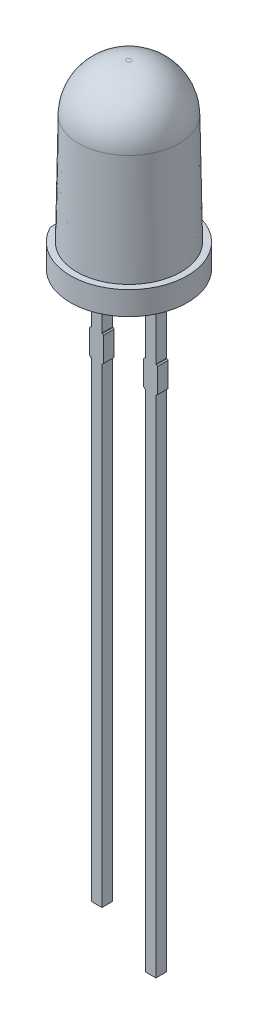
ISO-10303-21;
HEADER;
FILE_DESCRIPTION(('STEP AP214'),'2;1');
FILE_NAME('part.step','',(''),(''),'','','');
FILE_SCHEMA(('AUTOMOTIVE_DESIGN { 1 0 10303 214 1 1 1 1 }'));
ENDSEC;
DATA;
#1=APPLICATION_CONTEXT('core data for automotive mechanical design processes');
#2=APPLICATION_PROTOCOL_DEFINITION('international standard','automotive_design',2000,#1);
#3=PRODUCT_CONTEXT('',#1,'mechanical');
#4=PRODUCT('Part','Part','',(#3));
#5=PRODUCT_RELATED_PRODUCT_CATEGORY('part','',(#4));
#6=PRODUCT_DEFINITION_FORMATION('','',#4);
#7=PRODUCT_DEFINITION_CONTEXT('part definition',#1,'design');
#8=PRODUCT_DEFINITION('design','',#6,#7);
#9=PRODUCT_DEFINITION_SHAPE('','',#8);
#10=(LENGTH_UNIT() NAMED_UNIT(*) SI_UNIT(.MILLI.,.METRE.));
#11=(NAMED_UNIT(*) PLANE_ANGLE_UNIT() SI_UNIT($,.RADIAN.));
#12=(NAMED_UNIT(*) SI_UNIT($,.STERADIAN.) SOLID_ANGLE_UNIT());
#13=UNCERTAINTY_MEASURE_WITH_UNIT(LENGTH_MEASURE(1.E-05),#10,'distance_accuracy_value','');
#14=(GEOMETRIC_REPRESENTATION_CONTEXT(3) GLOBAL_UNCERTAINTY_ASSIGNED_CONTEXT((#13)) GLOBAL_UNIT_ASSIGNED_CONTEXT((#10,
#11,#12)) REPRESENTATION_CONTEXT('',''));
#15=CARTESIAN_POINT('',(0.,0.,0.));
#16=DIRECTION('',(0.,0.,1.));
#17=DIRECTION('',(1.,0.,0.));
#18=AXIS2_PLACEMENT_3D('',#15,#16,#17);
#19=CARTESIAN_POINT('',(-1.02,-28.,0.25));
#20=DIRECTION('',(-1.,0.,0.));
#21=DIRECTION('',(0.,0.,1.));
#22=AXIS2_PLACEMENT_3D('',#19,#20,#21);
#23=PLANE('',#22);
#24=DIRECTION('',(0.,1.,0.));
#25=VECTOR('',#24,1.);
#26=CARTESIAN_POINT('',(-1.02,-28.,0.25));
#27=LINE('',#26,#25);
#28=CARTESIAN_POINT('',(-1.02,-3.,0.25));
#29=VERTEX_POINT('',#28);
#30=CARTESIAN_POINT('',(-1.02,0.,0.25));
#31=VERTEX_POINT('',#30);
#32=EDGE_CURVE('E319',#29,#31,#27,.T.);
#33=ORIENTED_EDGE('',*,*,#32,.F.);
#34=DIRECTION('',(0.,0.,-1.));
#35=VECTOR('',#34,1.);
#36=CARTESIAN_POINT('',(-1.02,-3.,0.25));
#37=LINE('',#36,#35);
#38=CARTESIAN_POINT('',(-1.02,-3.,-0.25));
#39=VERTEX_POINT('',#38);
#40=EDGE_CURVE('E552',#29,#39,#37,.T.);
#41=ORIENTED_EDGE('',*,*,#40,.T.);
#42=DIRECTION('',(0.,1.,0.));
#43=VECTOR('',#42,1.);
#44=CARTESIAN_POINT('',(-1.02,-28.,-0.25));
#45=LINE('',#44,#43);
#46=CARTESIAN_POINT('',(-1.02,0.,-0.25));
#47=VERTEX_POINT('',#46);
#48=EDGE_CURVE('E368',#39,#47,#45,.T.);
#49=ORIENTED_EDGE('',*,*,#48,.T.);
#50=DIRECTION('',(0.,0.,1.));
#51=VECTOR('',#50,1.);
#52=CARTESIAN_POINT('',(-1.02,0.,0.25));
#53=LINE('',#52,#51);
#54=EDGE_CURVE('E485',#47,#31,#53,.T.);
#55=ORIENTED_EDGE('',*,*,#54,.T.);
#56=EDGE_LOOP('',(#33,#41,#49,#55));
#57=FACE_BOUND('',#56,.T.);
#58=ADVANCED_FACE('F48',(#57),#23,.F.);
#59=CARTESIAN_POINT('',(-1.52,-28.,0.25));
#60=DIRECTION('',(1.,0.,0.));
#61=DIRECTION('',(0.,0.,-1.));
#62=AXIS2_PLACEMENT_3D('',#59,#60,#61);
#63=PLANE('',#62);
#64=DIRECTION('',(0.,1.,0.));
#65=VECTOR('',#64,1.);
#66=CARTESIAN_POINT('',(-1.52,-28.,-0.25));
#67=LINE('',#66,#65);
#68=CARTESIAN_POINT('',(-1.52,-3.,-0.25));
#69=VERTEX_POINT('',#68);
#70=CARTESIAN_POINT('',(-1.52,0.,-0.25));
#71=VERTEX_POINT('',#70);
#72=EDGE_CURVE('E307',#69,#71,#67,.T.);
#73=ORIENTED_EDGE('',*,*,#72,.F.);
#74=DIRECTION('',(0.,0.,1.));
#75=VECTOR('',#74,1.);
#76=CARTESIAN_POINT('',(-1.52,-3.,0.25));
#77=LINE('',#76,#75);
#78=CARTESIAN_POINT('',(-1.52,-3.,0.25));
#79=VERTEX_POINT('',#78);
#80=EDGE_CURVE('E554',#69,#79,#77,.T.);
#81=ORIENTED_EDGE('',*,*,#80,.T.);
#82=DIRECTION('',(0.,1.,0.));
#83=VECTOR('',#82,1.);
#84=CARTESIAN_POINT('',(-1.52,-28.,0.25));
#85=LINE('',#84,#83);
#86=CARTESIAN_POINT('',(-1.52,0.,0.25));
#87=VERTEX_POINT('',#86);
#88=EDGE_CURVE('E306',#79,#87,#85,.T.);
#89=ORIENTED_EDGE('',*,*,#88,.T.);
#90=DIRECTION('',(0.,0.,-1.));
#91=VECTOR('',#90,1.);
#92=CARTESIAN_POINT('',(-1.52,0.,0.25));
#93=LINE('',#92,#91);
#94=EDGE_CURVE('E501',#87,#71,#93,.T.);
#95=ORIENTED_EDGE('',*,*,#94,.T.);
#96=EDGE_LOOP('',(#73,#81,#89,#95));
#97=FACE_BOUND('',#96,.T.);
#98=ADVANCED_FACE('F626',(#97),#63,.F.);
#99=CARTESIAN_POINT('',(1.52,-28.,0.25));
#100=DIRECTION('',(-1.,0.,0.));
#101=DIRECTION('',(0.,0.,1.));
#102=AXIS2_PLACEMENT_3D('',#99,#100,#101);
#103=PLANE('',#102);
#104=DIRECTION('',(0.,1.,0.));
#105=VECTOR('',#104,1.);
#106=CARTESIAN_POINT('',(1.52,-28.,0.25));
#107=LINE('',#106,#105);
#108=CARTESIAN_POINT('',(1.52,-3.,0.25));
#109=VERTEX_POINT('',#108);
#110=CARTESIAN_POINT('',(1.52,0.,0.25));
#111=VERTEX_POINT('',#110);
#112=EDGE_CURVE('E536',#109,#111,#107,.T.);
#113=ORIENTED_EDGE('',*,*,#112,.F.);
#114=DIRECTION('',(0.,0.,-1.));
#115=VECTOR('',#114,1.);
#116=CARTESIAN_POINT('',(1.52,-3.,0.25));
#117=LINE('',#116,#115);
#118=CARTESIAN_POINT('',(1.52,-3.,-0.25));
#119=VERTEX_POINT('',#118);
#120=EDGE_CURVE('E568',#109,#119,#117,.T.);
#121=ORIENTED_EDGE('',*,*,#120,.T.);
#122=DIRECTION('',(0.,1.,0.));
#123=VECTOR('',#122,1.);
#124=CARTESIAN_POINT('',(1.52,-28.,-0.25));
#125=LINE('',#124,#123);
#126=CARTESIAN_POINT('',(1.52,0.,-0.25));
#127=VERTEX_POINT('',#126);
#128=EDGE_CURVE('E543',#119,#127,#125,.T.);
#129=ORIENTED_EDGE('',*,*,#128,.T.);
#130=DIRECTION('',(0.,0.,1.));
#131=VECTOR('',#130,1.);
#132=CARTESIAN_POINT('',(1.52,0.,0.25));
#133=LINE('',#132,#131);
#134=EDGE_CURVE('E516',#127,#111,#133,.T.);
#135=ORIENTED_EDGE('',*,*,#134,.T.);
#136=EDGE_LOOP('',(#113,#121,#129,#135));
#137=FACE_BOUND('',#136,.T.);
#138=ADVANCED_FACE('F716',(#137),#103,.F.);
#139=CARTESIAN_POINT('',(1.02,-28.,0.25));
#140=DIRECTION('',(1.,0.,0.));
#141=DIRECTION('',(0.,0.,-1.));
#142=AXIS2_PLACEMENT_3D('',#139,#140,#141);
#143=PLANE('',#142);
#144=DIRECTION('',(0.,1.,0.));
#145=VECTOR('',#144,1.);
#146=CARTESIAN_POINT('',(1.02,-28.,-0.25));
#147=LINE('',#146,#145);
#148=CARTESIAN_POINT('',(1.02,-3.,-0.25));
#149=VERTEX_POINT('',#148);
#150=CARTESIAN_POINT('',(1.02,0.,-0.25));
#151=VERTEX_POINT('',#150);
#152=EDGE_CURVE('E542',#149,#151,#147,.T.);
#153=ORIENTED_EDGE('',*,*,#152,.F.);
#154=DIRECTION('',(0.,0.,1.));
#155=VECTOR('',#154,1.);
#156=CARTESIAN_POINT('',(1.02,-3.,0.25));
#157=LINE('',#156,#155);
#158=CARTESIAN_POINT('',(1.02,-3.,0.25));
#159=VERTEX_POINT('',#158);
#160=EDGE_CURVE('E493',#149,#159,#157,.T.);
#161=ORIENTED_EDGE('',*,*,#160,.T.);
#162=DIRECTION('',(0.,1.,0.));
#163=VECTOR('',#162,1.);
#164=CARTESIAN_POINT('',(1.02,-28.,0.25));
#165=LINE('',#164,#163);
#166=CARTESIAN_POINT('',(1.02,0.,0.25));
#167=VERTEX_POINT('',#166);
#168=EDGE_CURVE('E480',#159,#167,#165,.T.);
#169=ORIENTED_EDGE('',*,*,#168,.T.);
#170=DIRECTION('',(0.,0.,-1.));
#171=VECTOR('',#170,1.);
#172=CARTESIAN_POINT('',(1.02,0.,0.25));
#173=LINE('',#172,#171);
#174=EDGE_CURVE('E515',#167,#151,#173,.T.);
#175=ORIENTED_EDGE('',*,*,#174,.T.);
#176=EDGE_LOOP('',(#153,#161,#169,#175));
#177=FACE_BOUND('',#176,.T.);
#178=ADVANCED_FACE('F729',(#177),#143,.F.);
#179=CARTESIAN_POINT('',(0.,0.,0.));
#180=DIRECTION('',(0.,1.,0.));
#181=DIRECTION('',(0.,0.,1.));
#182=AXIS2_PLACEMENT_3D('',#179,#180,#181);
#183=PLANE('',#182);
#184=ORIENTED_EDGE('',*,*,#54,.F.);
#185=DIRECTION('',(1.,0.,0.));
#186=VECTOR('',#185,1.);
#187=CARTESIAN_POINT('',(-1.52,0.,-0.25));
#188=LINE('',#187,#186);
#189=EDGE_CURVE('E365',#71,#47,#188,.T.);
#190=ORIENTED_EDGE('',*,*,#189,.F.);
#191=ORIENTED_EDGE('',*,*,#94,.F.);
#192=DIRECTION('',(-1.,0.,0.));
#193=VECTOR('',#192,1.);
#194=CARTESIAN_POINT('',(-1.52,0.,0.25));
#195=LINE('',#194,#193);
#196=EDGE_CURVE('E488',#31,#87,#195,.T.);
#197=ORIENTED_EDGE('',*,*,#196,.F.);
#198=EDGE_LOOP('',(#184,#190,#191,#197));
#199=FACE_BOUND('',#198,.T.);
#200=CARTESIAN_POINT('',(0.,0.,0.));
#201=DIRECTION('',(0.,1.,0.));
#202=DIRECTION('',(0.,0.,1.));
#203=AXIS2_PLACEMENT_3D('',#200,#201,#202);
#204=CIRCLE('',#203,2.75);
#205=CARTESIAN_POINT('',(-2.45,0.,1.24899959967968));
#206=VERTEX_POINT('',#205);
#207=CARTESIAN_POINT('',(-2.45,0.,-1.24899959967968));
#208=VERTEX_POINT('',#207);
#209=EDGE_CURVE('E337',#206,#208,#204,.T.);
#210=ORIENTED_EDGE('',*,*,#209,.F.);
#211=DIRECTION('',(0.,0.,-1.));
#212=VECTOR('',#211,1.);
#213=CARTESIAN_POINT('',(-2.45,0.,-1.24899959967968));
#214=LINE('',#213,#212);
#215=EDGE_CURVE('E325',#206,#208,#214,.T.);
#216=ORIENTED_EDGE('',*,*,#215,.T.);
#217=EDGE_LOOP('',(#210,#216));
#218=FACE_BOUND('',#217,.T.);
#219=ORIENTED_EDGE('',*,*,#134,.F.);
#220=DIRECTION('',(1.,0.,0.));
#221=VECTOR('',#220,1.);
#222=CARTESIAN_POINT('',(1.02,0.,-0.25));
#223=LINE('',#222,#221);
#224=EDGE_CURVE('E531',#151,#127,#223,.T.);
#225=ORIENTED_EDGE('',*,*,#224,.F.);
#226=ORIENTED_EDGE('',*,*,#174,.F.);
#227=DIRECTION('',(-1.,0.,0.));
#228=VECTOR('',#227,1.);
#229=CARTESIAN_POINT('',(1.02,0.,0.25));
#230=LINE('',#229,#228);
#231=EDGE_CURVE('E512',#111,#167,#230,.T.);
#232=ORIENTED_EDGE('',*,*,#231,.F.);
#233=EDGE_LOOP('',(#219,#225,#226,#232));
#234=FACE_BOUND('',#233,.T.);
#235=ADVANCED_FACE('F633',(#199,#218,#234),#183,.F.);
#236=CARTESIAN_POINT('',(0.,1.1,0.));
#237=DIRECTION('',(0.,-1.,0.));
#238=DIRECTION('',(0.,0.,-1.));
#239=AXIS2_PLACEMENT_3D('',#236,#237,#238);
#240=CYLINDRICAL_SURFACE('',#239,2.75);
#241=CARTESIAN_POINT('',(0.,1.1,0.));
#242=DIRECTION('',(0.,1.,0.));
#243=DIRECTION('',(0.,0.,1.));
#244=AXIS2_PLACEMENT_3D('',#241,#242,#243);
#245=CIRCLE('',#244,2.75);
#246=CARTESIAN_POINT('',(-2.45,1.1,1.24899959967968));
#247=VERTEX_POINT('',#246);
#248=CARTESIAN_POINT('',(-2.45,1.1,-1.24899959967968));
#249=VERTEX_POINT('',#248);
#250=EDGE_CURVE('E345',#247,#249,#245,.T.);
#251=ORIENTED_EDGE('',*,*,#250,.F.);
#252=DIRECTION('',(0.,1.,0.));
#253=VECTOR('',#252,1.);
#254=CARTESIAN_POINT('',(-2.45,0.,1.24899959967968));
#255=LINE('',#254,#253);
#256=EDGE_CURVE('E329',#206,#247,#255,.T.);
#257=ORIENTED_EDGE('',*,*,#256,.F.);
#258=ORIENTED_EDGE('',*,*,#209,.T.);
#259=DIRECTION('',(0.,1.,0.));
#260=VECTOR('',#259,1.);
#261=CARTESIAN_POINT('',(-2.45,0.,-1.24899959967968));
#262=LINE('',#261,#260);
#263=EDGE_CURVE('E333',#208,#249,#262,.T.);
#264=ORIENTED_EDGE('',*,*,#263,.T.);
#265=EDGE_LOOP('',(#251,#257,#258,#264));
#266=FACE_BOUND('',#265,.T.);
#267=ADVANCED_FACE('F689',(#266),#240,.T.);
#268=CARTESIAN_POINT('',(0.,1.1,0.));
#269=DIRECTION('',(0.,1.,0.));
#270=DIRECTION('',(0.,0.,1.));
#271=AXIS2_PLACEMENT_3D('',#268,#269,#270);
#272=PLANE('',#271);
#273=DIRECTION('',(0.,0.,-1.));
#274=VECTOR('',#273,1.);
#275=CARTESIAN_POINT('',(-2.45,1.1,-1.24899959967968));
#276=LINE('',#275,#274);
#277=CARTESIAN_POINT('',(-2.45,1.1,0.));
#278=VERTEX_POINT('',#277);
#279=EDGE_CURVE('E330',#247,#278,#276,.T.);
#280=ORIENTED_EDGE('',*,*,#279,.F.);
#281=ORIENTED_EDGE('',*,*,#250,.T.);
#282=EDGE_CURVE('E324',#278,#249,#276,.T.);
#283=ORIENTED_EDGE('',*,*,#282,.F.);
#284=CARTESIAN_POINT('',(0.,1.1,0.));
#285=DIRECTION('',(0.,1.,0.));
#286=DIRECTION('',(0.,0.,1.));
#287=AXIS2_PLACEMENT_3D('',#284,#285,#286);
#288=CIRCLE('',#287,2.45);
#289=EDGE_CURVE('E340',#278,#278,#288,.T.);
#290=ORIENTED_EDGE('',*,*,#289,.F.);
#291=EDGE_LOOP('',(#280,#281,#283,#290));
#292=FACE_BOUND('',#291,.T.);
#293=ADVANCED_FACE('F692',(#292),#272,.T.);
#294=CARTESIAN_POINT('',(0.,8.5,0.));
#295=DIRECTION('',(0.,1.,0.));
#296=DIRECTION('',(0.,0.,1.));
#297=AXIS2_PLACEMENT_3D('',#294,#295,#296);
#298=PLANE('',#297);
#299=CARTESIAN_POINT('',(0.,8.5,0.));
#300=DIRECTION('',(0.,1.,0.));
#301=DIRECTION('',(0.,0.,1.));
#302=AXIS2_PLACEMENT_3D('',#299,#300,#301);
#303=CIRCLE('',#302,0.109763677520888);
#304=CARTESIAN_POINT('',(0.,8.5,0.109763677520888));
#305=VERTEX_POINT('',#304);
#306=EDGE_CURVE('E344',#305,#305,#303,.T.);
#307=ORIENTED_EDGE('',*,*,#306,.T.);
#308=EDGE_LOOP('',(#307));
#309=FACE_BOUND('',#308,.T.);
#310=ADVANCED_FACE('F697',(#309),#298,.T.);
#311=CARTESIAN_POINT('',(0.,1.1,0.));
#312=DIRECTION('',(0.,-1.,0.));
#313=DIRECTION('',(0.,0.,1.));
#314=AXIS2_PLACEMENT_3D('',#311,#312,#313);
#315=CONICAL_SURFACE('',#314,2.45,0.0174532925199433);
#316=CARTESIAN_POINT('',(0.,6.28926791448389,0.));
#317=DIRECTION('',(0.,1.,0.));
#318=DIRECTION('',(0.,0.,1.));
#319=AXIS2_PLACEMENT_3D('',#316,#317,#318);
#320=CIRCLE('',#319,2.35942099162277);
#321=CARTESIAN_POINT('',(0.,6.28926791448389,2.35942099162277));
#322=VERTEX_POINT('',#321);
#323=EDGE_CURVE('E355',#322,#322,#320,.F.);
#324=ORIENTED_EDGE('',*,*,#323,.T.);
#325=EDGE_LOOP('',(#324));
#326=FACE_BOUND('',#325,.T.);
#327=ORIENTED_EDGE('',*,*,#289,.T.);
#328=EDGE_LOOP('',(#327));
#329=FACE_BOUND('',#328,.T.);
#330=ADVANCED_FACE('F694',(#326,#329),#315,.T.);
#331=CARTESIAN_POINT('',(0.,6.25,0.));
#332=DIRECTION('',(0.,1.,0.));
#333=DIRECTION('',(0.,0.,1.));
#334=AXIS2_PLACEMENT_3D('',#331,#332,#333);
#335=DEGENERATE_TOROIDAL_SURFACE('',#334,0.109763677520888,2.25,.T.);
#336=ORIENTED_EDGE('',*,*,#323,.F.);
#337=EDGE_LOOP('',(#336));
#338=FACE_BOUND('',#337,.T.);
#339=ORIENTED_EDGE('',*,*,#306,.F.);
#340=EDGE_LOOP('',(#339));
#341=FACE_BOUND('',#340,.T.);
#342=ADVANCED_FACE('F696',(#338,#341),#335,.T.);
#343=CARTESIAN_POINT('',(-2.45,0.,-1.24899959967968));
#344=DIRECTION('',(1.,0.,0.));
#345=DIRECTION('',(0.,0.,-1.));
#346=AXIS2_PLACEMENT_3D('',#343,#344,#345);
#347=PLANE('',#346);
#348=ORIENTED_EDGE('',*,*,#279,.T.);
#349=ORIENTED_EDGE('',*,*,#282,.T.);
#350=ORIENTED_EDGE('',*,*,#263,.F.);
#351=ORIENTED_EDGE('',*,*,#215,.F.);
#352=ORIENTED_EDGE('',*,*,#256,.T.);
#353=EDGE_LOOP('',(#348,#349,#350,#351,#352));
#354=FACE_BOUND('',#353,.T.);
#355=ADVANCED_FACE('F683',(#354),#347,.F.);
#356=CARTESIAN_POINT('',(-1.02,-26.4,-0.25));
#357=VERTEX_POINT('',#356);
#358=CARTESIAN_POINT('',(-1.02,-4.25,-0.25));
#359=VERTEX_POINT('',#358);
#360=EDGE_CURVE('E314',#357,#359,#45,.T.);
#361=ORIENTED_EDGE('',*,*,#360,.T.);
#362=DIRECTION('',(0.,0.,1.));
#363=VECTOR('',#362,1.);
#364=CARTESIAN_POINT('',(-1.02,-4.25,0.25));
#365=LINE('',#364,#363);
#366=CARTESIAN_POINT('',(-1.02,-4.25,0.25));
#367=VERTEX_POINT('',#366);
#368=EDGE_CURVE('E299',#359,#367,#365,.T.);
#369=ORIENTED_EDGE('',*,*,#368,.T.);
#370=CARTESIAN_POINT('',(-1.02,-26.4,0.25));
#371=VERTEX_POINT('',#370);
#372=EDGE_CURVE('E320',#371,#367,#27,.T.);
#373=ORIENTED_EDGE('',*,*,#372,.F.);
#374=DIRECTION('',(0.,0.,1.));
#375=VECTOR('',#374,1.);
#376=CARTESIAN_POINT('',(-1.02,-26.4,0.25));
#377=LINE('',#376,#375);
#378=EDGE_CURVE('E360',#357,#371,#377,.T.);
#379=ORIENTED_EDGE('',*,*,#378,.F.);
#380=EDGE_LOOP('',(#361,#369,#373,#379));
#381=FACE_BOUND('',#380,.T.);
#382=ADVANCED_FACE('F663',(#381),#23,.F.);
#383=CARTESIAN_POINT('',(-1.52,-28.,0.25));
#384=DIRECTION('',(0.,0.,-1.));
#385=DIRECTION('',(-1.,0.,0.));
#386=AXIS2_PLACEMENT_3D('',#383,#384,#385);
#387=PLANE('',#386);
#388=DIRECTION('',(1.,0.,0.));
#389=VECTOR('',#388,1.);
#390=CARTESIAN_POINT('',(-1.595,-4.25,0.25));
#391=LINE('',#390,#389);
#392=CARTESIAN_POINT('',(-0.994999999999997,-4.25,0.25));
#393=VERTEX_POINT('',#392);
#394=EDGE_CURVE('E527',#367,#393,#391,.T.);
#395=ORIENTED_EDGE('',*,*,#394,.T.);
#396=DIRECTION('',(-0.707106781186548,-0.707106781186548,0.));
#397=VECTOR('',#396,1.);
#398=CARTESIAN_POINT('',(-0.994999999999997,-4.25,0.25));
#399=LINE('',#398,#397);
#400=CARTESIAN_POINT('',(-0.944999999999999,-4.2,0.25));
#401=VERTEX_POINT('',#400);
#402=EDGE_CURVE('E437',#393,#401,#399,.F.);
#403=ORIENTED_EDGE('',*,*,#402,.T.);
#404=DIRECTION('',(0.,1.,0.));
#405=VECTOR('',#404,1.);
#406=CARTESIAN_POINT('',(-0.945,-3.,0.25));
#407=LINE('',#406,#405);
#408=CARTESIAN_POINT('',(-0.945,-3.05,0.25));
#409=VERTEX_POINT('',#408);
#410=EDGE_CURVE('E474',#401,#409,#407,.T.);
#411=ORIENTED_EDGE('',*,*,#410,.T.);
#412=DIRECTION('',(0.707106781186547,-0.707106781186548,0.));
#413=VECTOR('',#412,1.);
#414=CARTESIAN_POINT('',(-0.945,-3.05,0.25));
#415=LINE('',#414,#413);
#416=CARTESIAN_POINT('',(-0.994999999999994,-3.,0.25));
#417=VERTEX_POINT('',#416);
#418=EDGE_CURVE('E434',#409,#417,#415,.F.);
#419=ORIENTED_EDGE('',*,*,#418,.T.);
#420=DIRECTION('',(-1.,0.,0.));
#421=VECTOR('',#420,1.);
#422=CARTESIAN_POINT('',(-1.595,-3.,0.25));
#423=LINE('',#422,#421);
#424=EDGE_CURVE('E508',#417,#29,#423,.T.);
#425=ORIENTED_EDGE('',*,*,#424,.T.);
#426=ORIENTED_EDGE('',*,*,#32,.T.);
#427=ORIENTED_EDGE('',*,*,#196,.T.);
#428=ORIENTED_EDGE('',*,*,#88,.F.);
#429=CARTESIAN_POINT('',(-1.54499999999999,-3.,0.25));
#430=VERTEX_POINT('',#429);
#431=EDGE_CURVE('E476',#79,#430,#423,.T.);
#432=ORIENTED_EDGE('',*,*,#431,.T.);
#433=DIRECTION('',(0.707106781186572,0.707106781186523,0.));
#434=VECTOR('',#433,1.);
#435=CARTESIAN_POINT('',(-1.54499999999999,-3.,0.25));
#436=LINE('',#435,#434);
#437=CARTESIAN_POINT('',(-1.595,-3.05,0.25));
#438=VERTEX_POINT('',#437);
#439=EDGE_CURVE('E429',#430,#438,#436,.F.);
#440=ORIENTED_EDGE('',*,*,#439,.T.);
#441=DIRECTION('',(0.,-1.,0.));
#442=VECTOR('',#441,1.);
#443=CARTESIAN_POINT('',(-1.595,-3.,0.25));
#444=LINE('',#443,#442);
#445=CARTESIAN_POINT('',(-1.595,-4.2,0.25));
#446=VERTEX_POINT('',#445);
#447=EDGE_CURVE('E525',#438,#446,#444,.T.);
#448=ORIENTED_EDGE('',*,*,#447,.T.);
#449=DIRECTION('',(-0.707106781186572,0.707106781186523,0.));
#450=VECTOR('',#449,1.);
#451=CARTESIAN_POINT('',(-1.595,-4.2,0.25));
#452=LINE('',#451,#450);
#453=CARTESIAN_POINT('',(-1.545,-4.25,0.25));
#454=VERTEX_POINT('',#453);
#455=EDGE_CURVE('E432',#446,#454,#452,.F.);
#456=ORIENTED_EDGE('',*,*,#455,.T.);
#457=CARTESIAN_POINT('',(-1.52,-4.25,0.25));
#458=VERTEX_POINT('',#457);
#459=EDGE_CURVE('E477',#454,#458,#391,.T.);
#460=ORIENTED_EDGE('',*,*,#459,.T.);
#461=CARTESIAN_POINT('',(-1.52,-26.4,0.25));
#462=VERTEX_POINT('',#461);
#463=EDGE_CURVE('E297',#462,#458,#85,.T.);
#464=ORIENTED_EDGE('',*,*,#463,.F.);
#465=DIRECTION('',(-1.,0.,0.));
#466=VECTOR('',#465,1.);
#467=CARTESIAN_POINT('',(-1.52,-26.4,0.25));
#468=LINE('',#467,#466);
#469=EDGE_CURVE('E364',#371,#462,#468,.T.);
#470=ORIENTED_EDGE('',*,*,#469,.F.);
#471=ORIENTED_EDGE('',*,*,#372,.T.);
#472=EDGE_LOOP('',(#395,#403,#411,#419,#425,#426,#427,#428,#432,#440,#448,#456,#460,#464,#470,#471));
#473=FACE_BOUND('',#472,.T.);
#474=ADVANCED_FACE('F636',(#473),#387,.F.);
#475=ORIENTED_EDGE('',*,*,#463,.T.);
#476=DIRECTION('',(0.,0.,-1.));
#477=VECTOR('',#476,1.);
#478=CARTESIAN_POINT('',(-1.52,-4.25,0.25));
#479=LINE('',#478,#477);
#480=CARTESIAN_POINT('',(-1.52,-4.25,-0.25));
#481=VERTEX_POINT('',#480);
#482=EDGE_CURVE('E281',#458,#481,#479,.T.);
#483=ORIENTED_EDGE('',*,*,#482,.T.);
#484=CARTESIAN_POINT('',(-1.52,-26.4,-0.25));
#485=VERTEX_POINT('',#484);
#486=EDGE_CURVE('E294',#485,#481,#67,.T.);
#487=ORIENTED_EDGE('',*,*,#486,.F.);
#488=DIRECTION('',(0.,0.,-1.));
#489=VECTOR('',#488,1.);
#490=CARTESIAN_POINT('',(-1.52,-26.4,0.25));
#491=LINE('',#490,#489);
#492=EDGE_CURVE('E369',#462,#485,#491,.T.);
#493=ORIENTED_EDGE('',*,*,#492,.F.);
#494=EDGE_LOOP('',(#475,#483,#487,#493));
#495=FACE_BOUND('',#494,.T.);
#496=ADVANCED_FACE('F292',(#495),#63,.F.);
#497=CARTESIAN_POINT('',(-1.52,-28.,-0.25));
#498=DIRECTION('',(0.,0.,1.));
#499=DIRECTION('',(1.,0.,0.));
#500=AXIS2_PLACEMENT_3D('',#497,#498,#499);
#501=PLANE('',#500);
#502=DIRECTION('',(0.,-1.,0.));
#503=VECTOR('',#502,1.);
#504=CARTESIAN_POINT('',(-0.945,-3.,-0.25));
#505=LINE('',#504,#503);
#506=CARTESIAN_POINT('',(-0.945,-3.05,-0.25));
#507=VERTEX_POINT('',#506);
#508=CARTESIAN_POINT('',(-0.944999999999999,-4.2,-0.25));
#509=VERTEX_POINT('',#508);
#510=EDGE_CURVE('E509',#507,#509,#505,.T.);
#511=ORIENTED_EDGE('',*,*,#510,.T.);
#512=DIRECTION('',(0.707106781186548,0.707106781186548,0.));
#513=VECTOR('',#512,1.);
#514=CARTESIAN_POINT('',(-0.994999999999997,-4.25,-0.25));
#515=LINE('',#514,#513);
#516=CARTESIAN_POINT('',(-0.994999999999997,-4.25,-0.25));
#517=VERTEX_POINT('',#516);
#518=EDGE_CURVE('E455',#509,#517,#515,.F.);
#519=ORIENTED_EDGE('',*,*,#518,.T.);
#520=DIRECTION('',(-1.,0.,0.));
#521=VECTOR('',#520,1.);
#522=CARTESIAN_POINT('',(-1.595,-4.25,-0.25));
#523=LINE('',#522,#521);
#524=EDGE_CURVE('E287',#517,#359,#523,.T.);
#525=ORIENTED_EDGE('',*,*,#524,.T.);
#526=ORIENTED_EDGE('',*,*,#360,.F.);
#527=DIRECTION('',(1.,0.,0.));
#528=VECTOR('',#527,1.);
#529=CARTESIAN_POINT('',(-1.52,-26.4,-0.25));
#530=LINE('',#529,#528);
#531=EDGE_CURVE('E304',#485,#357,#530,.T.);
#532=ORIENTED_EDGE('',*,*,#531,.F.);
#533=ORIENTED_EDGE('',*,*,#486,.T.);
#534=CARTESIAN_POINT('',(-1.545,-4.25,-0.25));
#535=VERTEX_POINT('',#534);
#536=EDGE_CURVE('E277',#481,#535,#523,.T.);
#537=ORIENTED_EDGE('',*,*,#536,.T.);
#538=DIRECTION('',(0.707106781186572,-0.707106781186523,0.));
#539=VECTOR('',#538,1.);
#540=CARTESIAN_POINT('',(-1.595,-4.2,-0.25));
#541=LINE('',#540,#539);
#542=CARTESIAN_POINT('',(-1.595,-4.2,-0.25));
#543=VERTEX_POINT('',#542);
#544=EDGE_CURVE('E449',#535,#543,#541,.F.);
#545=ORIENTED_EDGE('',*,*,#544,.T.);
#546=DIRECTION('',(0.,1.,0.));
#547=VECTOR('',#546,1.);
#548=CARTESIAN_POINT('',(-1.595,-3.,-0.25));
#549=LINE('',#548,#547);
#550=CARTESIAN_POINT('',(-1.595,-3.05,-0.25));
#551=VERTEX_POINT('',#550);
#552=EDGE_CURVE('E288',#543,#551,#549,.T.);
#553=ORIENTED_EDGE('',*,*,#552,.T.);
#554=DIRECTION('',(-0.707106781186572,-0.707106781186523,0.));
#555=VECTOR('',#554,1.);
#556=CARTESIAN_POINT('',(-1.54499999999999,-3.,-0.25));
#557=LINE('',#556,#555);
#558=CARTESIAN_POINT('',(-1.54499999999999,-3.,-0.25));
#559=VERTEX_POINT('',#558);
#560=EDGE_CURVE('E73',#551,#559,#557,.F.);
#561=ORIENTED_EDGE('',*,*,#560,.T.);
#562=DIRECTION('',(1.,0.,0.));
#563=VECTOR('',#562,1.);
#564=CARTESIAN_POINT('',(-1.595,-3.,-0.25));
#565=LINE('',#564,#563);
#566=EDGE_CURVE('E496',#559,#69,#565,.T.);
#567=ORIENTED_EDGE('',*,*,#566,.T.);
#568=ORIENTED_EDGE('',*,*,#72,.T.);
#569=ORIENTED_EDGE('',*,*,#189,.T.);
#570=ORIENTED_EDGE('',*,*,#48,.F.);
#571=CARTESIAN_POINT('',(-0.994999999999994,-3.,-0.25));
#572=VERTEX_POINT('',#571);
#573=EDGE_CURVE('E497',#39,#572,#565,.T.);
#574=ORIENTED_EDGE('',*,*,#573,.T.);
#575=DIRECTION('',(-0.707106781186547,0.707106781186548,0.));
#576=VECTOR('',#575,1.);
#577=CARTESIAN_POINT('',(-0.945,-3.05,-0.25));
#578=LINE('',#577,#576);
#579=EDGE_CURVE('E452',#572,#507,#578,.F.);
#580=ORIENTED_EDGE('',*,*,#579,.T.);
#581=EDGE_LOOP('',(#511,#519,#525,#526,#532,#533,#537,#545,#553,#561,#567,#568,#569,#570,#574,#580));
#582=FACE_BOUND('',#581,.T.);
#583=ADVANCED_FACE('F302',(#582),#501,.F.);
#584=CARTESIAN_POINT('',(0.,-26.4,0.));
#585=DIRECTION('',(0.,-1.,0.));
#586=DIRECTION('',(0.,0.,-1.));
#587=AXIS2_PLACEMENT_3D('',#584,#585,#586);
#588=PLANE('',#587);
#589=ORIENTED_EDGE('',*,*,#378,.T.);
#590=ORIENTED_EDGE('',*,*,#469,.T.);
#591=ORIENTED_EDGE('',*,*,#492,.T.);
#592=ORIENTED_EDGE('',*,*,#531,.T.);
#593=EDGE_LOOP('',(#589,#590,#591,#592));
#594=FACE_BOUND('',#593,.T.);
#595=ADVANCED_FACE('F771',(#594),#588,.T.);
#596=CARTESIAN_POINT('',(1.52,-28.,-0.25));
#597=VERTEX_POINT('',#596);
#598=CARTESIAN_POINT('',(1.52,-4.25,-0.25));
#599=VERTEX_POINT('',#598);
#600=EDGE_CURVE('E540',#597,#599,#125,.T.);
#601=ORIENTED_EDGE('',*,*,#600,.T.);
#602=DIRECTION('',(0.,0.,1.));
#603=VECTOR('',#602,1.);
#604=CARTESIAN_POINT('',(1.52,-4.25,0.25));
#605=LINE('',#604,#603);
#606=CARTESIAN_POINT('',(1.52,-4.25,0.25));
#607=VERTEX_POINT('',#606);
#608=EDGE_CURVE('E491',#599,#607,#605,.T.);
#609=ORIENTED_EDGE('',*,*,#608,.T.);
#610=CARTESIAN_POINT('',(1.52,-28.,0.25));
#611=VERTEX_POINT('',#610);
#612=EDGE_CURVE('E489',#611,#607,#107,.T.);
#613=ORIENTED_EDGE('',*,*,#612,.F.);
#614=DIRECTION('',(0.,0.,1.));
#615=VECTOR('',#614,1.);
#616=CARTESIAN_POINT('',(1.52,-28.,0.25));
#617=LINE('',#616,#615);
#618=EDGE_CURVE('E506',#597,#611,#617,.T.);
#619=ORIENTED_EDGE('',*,*,#618,.F.);
#620=EDGE_LOOP('',(#601,#609,#613,#619));
#621=FACE_BOUND('',#620,.T.);
#622=ADVANCED_FACE('F759',(#621),#103,.F.);
#623=CARTESIAN_POINT('',(1.02,-28.,0.25));
#624=DIRECTION('',(0.,0.,-1.));
#625=DIRECTION('',(-1.,0.,0.));
#626=AXIS2_PLACEMENT_3D('',#623,#624,#625);
#627=PLANE('',#626);
#628=DIRECTION('',(1.,0.,0.));
#629=VECTOR('',#628,1.);
#630=CARTESIAN_POINT('',(0.945000000000001,-4.25,0.25));
#631=LINE('',#630,#629);
#632=CARTESIAN_POINT('',(1.545,-4.25,0.25));
#633=VERTEX_POINT('',#632);
#634=EDGE_CURVE('E519',#607,#633,#631,.T.);
#635=ORIENTED_EDGE('',*,*,#634,.T.);
#636=DIRECTION('',(-0.707106781186549,-0.707106781186546,0.));
#637=VECTOR('',#636,1.);
#638=CARTESIAN_POINT('',(1.545,-4.25,0.25));
#639=LINE('',#638,#637);
#640=CARTESIAN_POINT('',(1.595,-4.2,0.25));
#641=VERTEX_POINT('',#640);
#642=EDGE_CURVE('E386',#633,#641,#639,.F.);
#643=ORIENTED_EDGE('',*,*,#642,.T.);
#644=DIRECTION('',(0.,1.,0.));
#645=VECTOR('',#644,1.);
#646=CARTESIAN_POINT('',(1.595,-3.,0.25));
#647=LINE('',#646,#645);
#648=CARTESIAN_POINT('',(1.595,-3.05,0.25));
#649=VERTEX_POINT('',#648);
#650=EDGE_CURVE('E587',#641,#649,#647,.T.);
#651=ORIENTED_EDGE('',*,*,#650,.T.);
#652=DIRECTION('',(0.707106781186548,-0.707106781186548,0.));
#653=VECTOR('',#652,1.);
#654=CARTESIAN_POINT('',(1.595,-3.05,0.25));
#655=LINE('',#654,#653);
#656=CARTESIAN_POINT('',(1.54500000000001,-3.,0.25));
#657=VERTEX_POINT('',#656);
#658=EDGE_CURVE('E383',#649,#657,#655,.F.);
#659=ORIENTED_EDGE('',*,*,#658,.T.);
#660=DIRECTION('',(-1.,0.,0.));
#661=VECTOR('',#660,1.);
#662=CARTESIAN_POINT('',(0.945,-3.,0.25));
#663=LINE('',#662,#661);
#664=EDGE_CURVE('E471',#657,#109,#663,.T.);
#665=ORIENTED_EDGE('',*,*,#664,.T.);
#666=ORIENTED_EDGE('',*,*,#112,.T.);
#667=ORIENTED_EDGE('',*,*,#231,.T.);
#668=ORIENTED_EDGE('',*,*,#168,.F.);
#669=CARTESIAN_POINT('',(0.995000000000005,-3.,0.25));
#670=VERTEX_POINT('',#669);
#671=EDGE_CURVE('E574',#159,#670,#663,.T.);
#672=ORIENTED_EDGE('',*,*,#671,.T.);
#673=DIRECTION('',(0.707106781186571,0.707106781186524,0.));
#674=VECTOR('',#673,1.);
#675=CARTESIAN_POINT('',(0.995000000000005,-3.,0.25));
#676=LINE('',#675,#674);
#677=CARTESIAN_POINT('',(0.945,-3.05,0.25));
#678=VERTEX_POINT('',#677);
#679=EDGE_CURVE('E380',#670,#678,#676,.F.);
#680=ORIENTED_EDGE('',*,*,#679,.T.);
#681=DIRECTION('',(0.,-1.,0.));
#682=VECTOR('',#681,1.);
#683=CARTESIAN_POINT('',(0.945,-3.,0.25));
#684=LINE('',#683,#682);
#685=CARTESIAN_POINT('',(0.945000000000001,-4.2,0.25));
#686=VERTEX_POINT('',#685);
#687=EDGE_CURVE('E523',#678,#686,#684,.T.);
#688=ORIENTED_EDGE('',*,*,#687,.T.);
#689=DIRECTION('',(-0.707106781186569,0.707106781186526,0.));
#690=VECTOR('',#689,1.);
#691=CARTESIAN_POINT('',(0.945000000000001,-4.2,0.25));
#692=LINE('',#691,#690);
#693=CARTESIAN_POINT('',(0.995000000000002,-4.25,0.25));
#694=VERTEX_POINT('',#693);
#695=EDGE_CURVE('E377',#686,#694,#692,.F.);
#696=ORIENTED_EDGE('',*,*,#695,.T.);
#697=CARTESIAN_POINT('',(1.02,-4.25,0.25));
#698=VERTEX_POINT('',#697);
#699=EDGE_CURVE('E522',#694,#698,#631,.T.);
#700=ORIENTED_EDGE('',*,*,#699,.T.);
#701=CARTESIAN_POINT('',(1.02,-28.,0.25));
#702=VERTEX_POINT('',#701);
#703=EDGE_CURVE('E482',#702,#698,#165,.T.);
#704=ORIENTED_EDGE('',*,*,#703,.F.);
#705=DIRECTION('',(-1.,0.,0.));
#706=VECTOR('',#705,1.);
#707=CARTESIAN_POINT('',(1.02,-28.,0.25));
#708=LINE('',#707,#706);
#709=EDGE_CURVE('E503',#611,#702,#708,.T.);
#710=ORIENTED_EDGE('',*,*,#709,.F.);
#711=ORIENTED_EDGE('',*,*,#612,.T.);
#712=EDGE_LOOP('',(#635,#643,#651,#659,#665,#666,#667,#668,#672,#680,#688,#696,#700,#704,#710,#711));
#713=FACE_BOUND('',#712,.T.);
#714=ADVANCED_FACE('F753',(#713),#627,.F.);
#715=ORIENTED_EDGE('',*,*,#703,.T.);
#716=DIRECTION('',(0.,0.,-1.));
#717=VECTOR('',#716,1.);
#718=CARTESIAN_POINT('',(1.02,-4.25,0.25));
#719=LINE('',#718,#717);
#720=CARTESIAN_POINT('',(1.02,-4.25,-0.25));
#721=VERTEX_POINT('',#720);
#722=EDGE_CURVE('E494',#698,#721,#719,.T.);
#723=ORIENTED_EDGE('',*,*,#722,.T.);
#724=CARTESIAN_POINT('',(1.02,-28.,-0.25));
#725=VERTEX_POINT('',#724);
#726=EDGE_CURVE('E483',#725,#721,#147,.T.);
#727=ORIENTED_EDGE('',*,*,#726,.F.);
#728=DIRECTION('',(0.,0.,-1.));
#729=VECTOR('',#728,1.);
#730=CARTESIAN_POINT('',(1.02,-28.,0.25));
#731=LINE('',#730,#729);
#732=EDGE_CURVE('E505',#702,#725,#731,.T.);
#733=ORIENTED_EDGE('',*,*,#732,.F.);
#734=EDGE_LOOP('',(#715,#723,#727,#733));
#735=FACE_BOUND('',#734,.T.);
#736=ADVANCED_FACE('F758',(#735),#143,.F.);
#737=CARTESIAN_POINT('',(1.02,-28.,-0.25));
#738=DIRECTION('',(0.,0.,1.));
#739=DIRECTION('',(1.,0.,0.));
#740=AXIS2_PLACEMENT_3D('',#737,#738,#739);
#741=PLANE('',#740);
#742=DIRECTION('',(0.,-1.,0.));
#743=VECTOR('',#742,1.);
#744=CARTESIAN_POINT('',(1.595,-3.,-0.25));
#745=LINE('',#744,#743);
#746=CARTESIAN_POINT('',(1.595,-3.05,-0.25));
#747=VERTEX_POINT('',#746);
#748=CARTESIAN_POINT('',(1.595,-4.2,-0.25));
#749=VERTEX_POINT('',#748);
#750=EDGE_CURVE('E468',#747,#749,#745,.T.);
#751=ORIENTED_EDGE('',*,*,#750,.T.);
#752=DIRECTION('',(0.707106781186549,0.707106781186546,0.));
#753=VECTOR('',#752,1.);
#754=CARTESIAN_POINT('',(1.545,-4.25,-0.25));
#755=LINE('',#754,#753);
#756=CARTESIAN_POINT('',(1.545,-4.25,-0.25));
#757=VERTEX_POINT('',#756);
#758=EDGE_CURVE('E405',#749,#757,#755,.F.);
#759=ORIENTED_EDGE('',*,*,#758,.T.);
#760=DIRECTION('',(-1.,0.,0.));
#761=VECTOR('',#760,1.);
#762=CARTESIAN_POINT('',(0.945000000000001,-4.25,-0.25));
#763=LINE('',#762,#761);
#764=EDGE_CURVE('E558',#757,#599,#763,.T.);
#765=ORIENTED_EDGE('',*,*,#764,.T.);
#766=ORIENTED_EDGE('',*,*,#600,.F.);
#767=DIRECTION('',(1.,0.,0.));
#768=VECTOR('',#767,1.);
#769=CARTESIAN_POINT('',(1.02,-28.,-0.25));
#770=LINE('',#769,#768);
#771=EDGE_CURVE('E583',#725,#597,#770,.T.);
#772=ORIENTED_EDGE('',*,*,#771,.F.);
#773=ORIENTED_EDGE('',*,*,#726,.T.);
#774=CARTESIAN_POINT('',(0.995000000000002,-4.25,-0.25));
#775=VERTEX_POINT('',#774);
#776=EDGE_CURVE('E572',#721,#775,#763,.T.);
#777=ORIENTED_EDGE('',*,*,#776,.T.);
#778=DIRECTION('',(0.707106781186569,-0.707106781186526,0.));
#779=VECTOR('',#778,1.);
#780=CARTESIAN_POINT('',(0.945000000000001,-4.2,-0.25));
#781=LINE('',#780,#779);
#782=CARTESIAN_POINT('',(0.945000000000001,-4.2,-0.25));
#783=VERTEX_POINT('',#782);
#784=EDGE_CURVE('E396',#775,#783,#781,.F.);
#785=ORIENTED_EDGE('',*,*,#784,.T.);
#786=DIRECTION('',(0.,1.,0.));
#787=VECTOR('',#786,1.);
#788=CARTESIAN_POINT('',(0.945,-3.,-0.25));
#789=LINE('',#788,#787);
#790=CARTESIAN_POINT('',(0.945,-3.05,-0.25));
#791=VERTEX_POINT('',#790);
#792=EDGE_CURVE('E549',#783,#791,#789,.T.);
#793=ORIENTED_EDGE('',*,*,#792,.T.);
#794=DIRECTION('',(-0.707106781186571,-0.707106781186524,0.));
#795=VECTOR('',#794,1.);
#796=CARTESIAN_POINT('',(0.995000000000005,-3.,-0.25));
#797=LINE('',#796,#795);
#798=CARTESIAN_POINT('',(0.995000000000005,-3.,-0.25));
#799=VERTEX_POINT('',#798);
#800=EDGE_CURVE('E399',#791,#799,#797,.F.);
#801=ORIENTED_EDGE('',*,*,#800,.T.);
#802=DIRECTION('',(1.,0.,0.));
#803=VECTOR('',#802,1.);
#804=CARTESIAN_POINT('',(0.945,-3.,-0.25));
#805=LINE('',#804,#803);
#806=EDGE_CURVE('E548',#799,#149,#805,.T.);
#807=ORIENTED_EDGE('',*,*,#806,.T.);
#808=ORIENTED_EDGE('',*,*,#152,.T.);
#809=ORIENTED_EDGE('',*,*,#224,.T.);
#810=ORIENTED_EDGE('',*,*,#128,.F.);
#811=CARTESIAN_POINT('',(1.54500000000001,-3.,-0.25));
#812=VERTEX_POINT('',#811);
#813=EDGE_CURVE('E470',#119,#812,#805,.T.);
#814=ORIENTED_EDGE('',*,*,#813,.T.);
#815=DIRECTION('',(-0.707106781186548,0.707106781186548,0.));
#816=VECTOR('',#815,1.);
#817=CARTESIAN_POINT('',(1.595,-3.05,-0.25));
#818=LINE('',#817,#816);
#819=EDGE_CURVE('E402',#812,#747,#818,.F.);
#820=ORIENTED_EDGE('',*,*,#819,.T.);
#821=EDGE_LOOP('',(#751,#759,#765,#766,#772,#773,#777,#785,#793,#801,#807,#808,#809,#810,#814,#820));
#822=FACE_BOUND('',#821,.T.);
#823=ADVANCED_FACE('F781',(#822),#741,.F.);
#824=CARTESIAN_POINT('',(0.,-28.,0.));
#825=DIRECTION('',(0.,-1.,0.));
#826=DIRECTION('',(0.,0.,-1.));
#827=AXIS2_PLACEMENT_3D('',#824,#825,#826);
#828=PLANE('',#827);
#829=ORIENTED_EDGE('',*,*,#618,.T.);
#830=ORIENTED_EDGE('',*,*,#709,.T.);
#831=ORIENTED_EDGE('',*,*,#732,.T.);
#832=ORIENTED_EDGE('',*,*,#771,.T.);
#833=EDGE_LOOP('',(#829,#830,#831,#832));
#834=FACE_BOUND('',#833,.T.);
#835=ADVANCED_FACE('F791',(#834),#828,.T.);
#836=CARTESIAN_POINT('',(0.945,-3.,-1.65890028036054));
#837=DIRECTION('',(-1.,0.,0.));
#838=DIRECTION('',(0.,-1.,0.));
#839=AXIS2_PLACEMENT_3D('',#836,#837,#838);
#840=PLANE('',#839);
#841=ORIENTED_EDGE('',*,*,#687,.F.);
#842=DIRECTION('',(0.,0.,-1.));
#843=VECTOR('',#842,1.);
#844=CARTESIAN_POINT('',(0.945,-3.05,-1.65890028036054));
#845=LINE('',#844,#843);
#846=EDGE_CURVE('E419',#678,#791,#845,.T.);
#847=ORIENTED_EDGE('',*,*,#846,.T.);
#848=ORIENTED_EDGE('',*,*,#792,.F.);
#849=DIRECTION('',(0.,0.,1.));
#850=VECTOR('',#849,1.);
#851=CARTESIAN_POINT('',(0.945000000000001,-4.2,-1.65890028036054));
#852=LINE('',#851,#850);
#853=EDGE_CURVE('E415',#783,#686,#852,.T.);
#854=ORIENTED_EDGE('',*,*,#853,.T.);
#855=EDGE_LOOP('',(#841,#847,#848,#854));
#856=FACE_BOUND('',#855,.T.);
#857=ADVANCED_FACE('F799',(#856),#840,.T.);
#858=CARTESIAN_POINT('',(0.945000000000001,-4.25,-1.65890028036054));
#859=DIRECTION('',(0.,-1.,0.));
#860=DIRECTION('',(0.,0.,-1.));
#861=AXIS2_PLACEMENT_3D('',#858,#859,#860);
#862=PLANE('',#861);
#863=ORIENTED_EDGE('',*,*,#699,.F.);
#864=DIRECTION('',(0.,0.,-1.));
#865=VECTOR('',#864,1.);
#866=CARTESIAN_POINT('',(0.995000000000002,-4.25,-1.65890028036054));
#867=LINE('',#866,#865);
#868=EDGE_CURVE('E422',#694,#775,#867,.T.);
#869=ORIENTED_EDGE('',*,*,#868,.T.);
#870=ORIENTED_EDGE('',*,*,#776,.F.);
#871=ORIENTED_EDGE('',*,*,#722,.F.);
#872=EDGE_LOOP('',(#863,#869,#870,#871));
#873=FACE_BOUND('',#872,.T.);
#874=ADVANCED_FACE('F807',(#873),#862,.T.);
#875=CARTESIAN_POINT('',(0.945,-3.,-1.65890028036054));
#876=DIRECTION('',(0.,1.,0.));
#877=DIRECTION('',(0.,0.,1.));
#878=AXIS2_PLACEMENT_3D('',#875,#876,#877);
#879=PLANE('',#878);
#880=ORIENTED_EDGE('',*,*,#806,.F.);
#881=DIRECTION('',(0.,0.,1.));
#882=VECTOR('',#881,1.);
#883=CARTESIAN_POINT('',(0.995000000000005,-3.,-1.65890028036054));
#884=LINE('',#883,#882);
#885=EDGE_CURVE('E411',#799,#670,#884,.T.);
#886=ORIENTED_EDGE('',*,*,#885,.T.);
#887=ORIENTED_EDGE('',*,*,#671,.F.);
#888=ORIENTED_EDGE('',*,*,#160,.F.);
#889=EDGE_LOOP('',(#880,#886,#887,#888));
#890=FACE_BOUND('',#889,.T.);
#891=ADVANCED_FACE('F815',(#890),#879,.T.);
#892=ORIENTED_EDGE('',*,*,#664,.F.);
#893=DIRECTION('',(0.,0.,-1.));
#894=VECTOR('',#893,1.);
#895=CARTESIAN_POINT('',(1.54500000000001,-3.,-1.65890028036054));
#896=LINE('',#895,#894);
#897=EDGE_CURVE('E408',#657,#812,#896,.T.);
#898=ORIENTED_EDGE('',*,*,#897,.T.);
#899=ORIENTED_EDGE('',*,*,#813,.F.);
#900=ORIENTED_EDGE('',*,*,#120,.F.);
#901=EDGE_LOOP('',(#892,#898,#899,#900));
#902=FACE_BOUND('',#901,.T.);
#903=ADVANCED_FACE('F824',(#902),#879,.T.);
#904=ORIENTED_EDGE('',*,*,#764,.F.);
#905=DIRECTION('',(0.,0.,1.));
#906=VECTOR('',#905,1.);
#907=CARTESIAN_POINT('',(1.545,-4.25,-1.65890028036054));
#908=LINE('',#907,#906);
#909=EDGE_CURVE('E359',#757,#633,#908,.T.);
#910=ORIENTED_EDGE('',*,*,#909,.T.);
#911=ORIENTED_EDGE('',*,*,#634,.F.);
#912=ORIENTED_EDGE('',*,*,#608,.F.);
#913=EDGE_LOOP('',(#904,#910,#911,#912));
#914=FACE_BOUND('',#913,.T.);
#915=ADVANCED_FACE('F818',(#914),#862,.T.);
#916=CARTESIAN_POINT('',(1.595,-3.,-1.65890028036054));
#917=DIRECTION('',(1.,0.,0.));
#918=DIRECTION('',(0.,1.,0.));
#919=AXIS2_PLACEMENT_3D('',#916,#917,#918);
#920=PLANE('',#919);
#921=ORIENTED_EDGE('',*,*,#650,.F.);
#922=DIRECTION('',(0.,0.,-1.));
#923=VECTOR('',#922,1.);
#924=CARTESIAN_POINT('',(1.595,-4.2,-1.65890028036054));
#925=LINE('',#924,#923);
#926=EDGE_CURVE('E393',#641,#749,#925,.T.);
#927=ORIENTED_EDGE('',*,*,#926,.T.);
#928=ORIENTED_EDGE('',*,*,#750,.F.);
#929=DIRECTION('',(0.,0.,1.));
#930=VECTOR('',#929,1.);
#931=CARTESIAN_POINT('',(1.595,-3.05,-1.65890028036054));
#932=LINE('',#931,#930);
#933=EDGE_CURVE('E389',#747,#649,#932,.T.);
#934=ORIENTED_EDGE('',*,*,#933,.T.);
#935=EDGE_LOOP('',(#921,#927,#928,#934));
#936=FACE_BOUND('',#935,.T.);
#937=ADVANCED_FACE('F838',(#936),#920,.T.);
#938=CARTESIAN_POINT('',(-1.595,-3.,-1.65890028036054));
#939=DIRECTION('',(-1.,0.,0.));
#940=DIRECTION('',(0.,0.,1.));
#941=AXIS2_PLACEMENT_3D('',#938,#939,#940);
#942=PLANE('',#941);
#943=ORIENTED_EDGE('',*,*,#552,.F.);
#944=DIRECTION('',(0.,0.,1.));
#945=VECTOR('',#944,1.);
#946=CARTESIAN_POINT('',(-1.595,-4.2,-1.65890028036054));
#947=LINE('',#946,#945);
#948=EDGE_CURVE('E463',#543,#446,#947,.T.);
#949=ORIENTED_EDGE('',*,*,#948,.T.);
#950=ORIENTED_EDGE('',*,*,#447,.F.);
#951=DIRECTION('',(0.,0.,-1.));
#952=VECTOR('',#951,1.);
#953=CARTESIAN_POINT('',(-1.595,-3.05,-1.65890028036054));
#954=LINE('',#953,#952);
#955=EDGE_CURVE('E460',#438,#551,#954,.T.);
#956=ORIENTED_EDGE('',*,*,#955,.T.);
#957=EDGE_LOOP('',(#943,#949,#950,#956));
#958=FACE_BOUND('',#957,.T.);
#959=ADVANCED_FACE('F845',(#958),#942,.T.);
#960=CARTESIAN_POINT('',(-1.595,-4.25,-1.65890028036054));
#961=DIRECTION('',(0.,-1.,0.));
#962=DIRECTION('',(0.,0.,-1.));
#963=AXIS2_PLACEMENT_3D('',#960,#961,#962);
#964=PLANE('',#963);
#965=ORIENTED_EDGE('',*,*,#459,.F.);
#966=DIRECTION('',(0.,0.,-1.));
#967=VECTOR('',#966,1.);
#968=CARTESIAN_POINT('',(-1.545,-4.25,-1.65890028036054));
#969=LINE('',#968,#967);
#970=EDGE_CURVE('E58',#454,#535,#969,.T.);
#971=ORIENTED_EDGE('',*,*,#970,.T.);
#972=ORIENTED_EDGE('',*,*,#536,.F.);
#973=ORIENTED_EDGE('',*,*,#482,.F.);
#974=EDGE_LOOP('',(#965,#971,#972,#973));
#975=FACE_BOUND('',#974,.T.);
#976=ADVANCED_FACE('F280',(#975),#964,.T.);
#977=CARTESIAN_POINT('',(-1.595,-3.,-1.65890028036054));
#978=DIRECTION('',(0.,1.,0.));
#979=DIRECTION('',(0.,0.,1.));
#980=AXIS2_PLACEMENT_3D('',#977,#978,#979);
#981=PLANE('',#980);
#982=ORIENTED_EDGE('',*,*,#566,.F.);
#983=DIRECTION('',(0.,0.,1.));
#984=VECTOR('',#983,1.);
#985=CARTESIAN_POINT('',(-1.54499999999999,-3.,-1.65890028036054));
#986=LINE('',#985,#984);
#987=EDGE_CURVE('E13',#559,#430,#986,.T.);
#988=ORIENTED_EDGE('',*,*,#987,.T.);
#989=ORIENTED_EDGE('',*,*,#431,.F.);
#990=ORIENTED_EDGE('',*,*,#80,.F.);
#991=EDGE_LOOP('',(#982,#988,#989,#990));
#992=FACE_BOUND('',#991,.T.);
#993=ADVANCED_FACE('F677',(#992),#981,.T.);
#994=ORIENTED_EDGE('',*,*,#424,.F.);
#995=DIRECTION('',(0.,0.,-1.));
#996=VECTOR('',#995,1.);
#997=CARTESIAN_POINT('',(-0.994999999999994,-3.,-1.65890028036054));
#998=LINE('',#997,#996);
#999=EDGE_CURVE('E65',#417,#572,#998,.T.);
#1000=ORIENTED_EDGE('',*,*,#999,.T.);
#1001=ORIENTED_EDGE('',*,*,#573,.F.);
#1002=ORIENTED_EDGE('',*,*,#40,.F.);
#1003=EDGE_LOOP('',(#994,#1000,#1001,#1002));
#1004=FACE_BOUND('',#1003,.T.);
#1005=ADVANCED_FACE('F641',(#1004),#981,.T.);
#1006=ORIENTED_EDGE('',*,*,#524,.F.);
#1007=DIRECTION('',(0.,0.,1.));
#1008=VECTOR('',#1007,1.);
#1009=CARTESIAN_POINT('',(-0.994999999999997,-4.25,-1.65890028036054));
#1010=LINE('',#1009,#1008);
#1011=EDGE_CURVE('E425',#517,#393,#1010,.T.);
#1012=ORIENTED_EDGE('',*,*,#1011,.T.);
#1013=ORIENTED_EDGE('',*,*,#394,.F.);
#1014=ORIENTED_EDGE('',*,*,#368,.F.);
#1015=EDGE_LOOP('',(#1006,#1012,#1013,#1014));
#1016=FACE_BOUND('',#1015,.T.);
#1017=ADVANCED_FACE('F658',(#1016),#964,.T.);
#1018=CARTESIAN_POINT('',(-0.945,-3.,-1.65890028036054));
#1019=DIRECTION('',(1.,0.,0.));
#1020=DIRECTION('',(0.,1.,0.));
#1021=AXIS2_PLACEMENT_3D('',#1018,#1019,#1020);
#1022=PLANE('',#1021);
#1023=ORIENTED_EDGE('',*,*,#410,.F.);
#1024=DIRECTION('',(0.,0.,-1.));
#1025=VECTOR('',#1024,1.);
#1026=CARTESIAN_POINT('',(-0.944999999999999,-4.2,-1.65890028036054));
#1027=LINE('',#1026,#1025);
#1028=EDGE_CURVE('E444',#401,#509,#1027,.T.);
#1029=ORIENTED_EDGE('',*,*,#1028,.T.);
#1030=ORIENTED_EDGE('',*,*,#510,.F.);
#1031=DIRECTION('',(0.,0.,1.));
#1032=VECTOR('',#1031,1.);
#1033=CARTESIAN_POINT('',(-0.945,-3.05,-1.65890028036054));
#1034=LINE('',#1033,#1032);
#1035=EDGE_CURVE('E440',#507,#409,#1034,.T.);
#1036=ORIENTED_EDGE('',*,*,#1035,.T.);
#1037=EDGE_LOOP('',(#1023,#1029,#1030,#1036));
#1038=FACE_BOUND('',#1037,.T.);
#1039=ADVANCED_FACE('F649',(#1038),#1022,.T.);
#1040=CARTESIAN_POINT('',(1.545,-4.25,-1.65890028036054));
#1041=DIRECTION('',(-0.707106781186546,0.707106781186549,0.));
#1042=DIRECTION('',(0.,0.,1.));
#1043=AXIS2_PLACEMENT_3D('',#1040,#1041,#1042);
#1044=PLANE('',#1043);
#1045=ORIENTED_EDGE('',*,*,#758,.F.);
#1046=ORIENTED_EDGE('',*,*,#926,.F.);
#1047=ORIENTED_EDGE('',*,*,#642,.F.);
#1048=ORIENTED_EDGE('',*,*,#909,.F.);
#1049=EDGE_LOOP('',(#1045,#1046,#1047,#1048));
#1050=FACE_BOUND('',#1049,.T.);
#1051=ADVANCED_FACE('F882',(#1050),#1044,.F.);
#1052=CARTESIAN_POINT('',(1.595,-3.05,-1.65890028036054));
#1053=DIRECTION('',(-0.707106781186548,-0.707106781186548,0.));
#1054=DIRECTION('',(0.,0.,1.));
#1055=AXIS2_PLACEMENT_3D('',#1052,#1053,#1054);
#1056=PLANE('',#1055);
#1057=ORIENTED_EDGE('',*,*,#819,.F.);
#1058=ORIENTED_EDGE('',*,*,#897,.F.);
#1059=ORIENTED_EDGE('',*,*,#658,.F.);
#1060=ORIENTED_EDGE('',*,*,#933,.F.);
#1061=EDGE_LOOP('',(#1057,#1058,#1059,#1060));
#1062=FACE_BOUND('',#1061,.T.);
#1063=ADVANCED_FACE('F889',(#1062),#1056,.F.);
#1064=CARTESIAN_POINT('',(0.995000000000005,-3.,-1.65890028036054));
#1065=DIRECTION('',(0.707106781186524,-0.707106781186571,0.));
#1066=DIRECTION('',(0.,0.,1.));
#1067=AXIS2_PLACEMENT_3D('',#1064,#1065,#1066);
#1068=PLANE('',#1067);
#1069=ORIENTED_EDGE('',*,*,#800,.F.);
#1070=ORIENTED_EDGE('',*,*,#846,.F.);
#1071=ORIENTED_EDGE('',*,*,#679,.F.);
#1072=ORIENTED_EDGE('',*,*,#885,.F.);
#1073=EDGE_LOOP('',(#1069,#1070,#1071,#1072));
#1074=FACE_BOUND('',#1073,.T.);
#1075=ADVANCED_FACE('F897',(#1074),#1068,.F.);
#1076=CARTESIAN_POINT('',(0.945000000000001,-4.2,-1.65890028036054));
#1077=DIRECTION('',(0.707106781186526,0.707106781186569,0.));
#1078=DIRECTION('',(0.,0.,1.));
#1079=AXIS2_PLACEMENT_3D('',#1076,#1077,#1078);
#1080=PLANE('',#1079);
#1081=ORIENTED_EDGE('',*,*,#784,.F.);
#1082=ORIENTED_EDGE('',*,*,#868,.F.);
#1083=ORIENTED_EDGE('',*,*,#695,.F.);
#1084=ORIENTED_EDGE('',*,*,#853,.F.);
#1085=EDGE_LOOP('',(#1081,#1082,#1083,#1084));
#1086=FACE_BOUND('',#1085,.T.);
#1087=ADVANCED_FACE('F905',(#1086),#1080,.F.);
#1088=CARTESIAN_POINT('',(-0.994999999999997,-4.25,-1.65890028036054));
#1089=DIRECTION('',(-0.707106781186548,0.707106781186548,0.));
#1090=DIRECTION('',(0.,0.,1.));
#1091=AXIS2_PLACEMENT_3D('',#1088,#1089,#1090);
#1092=PLANE('',#1091);
#1093=ORIENTED_EDGE('',*,*,#518,.F.);
#1094=ORIENTED_EDGE('',*,*,#1028,.F.);
#1095=ORIENTED_EDGE('',*,*,#402,.F.);
#1096=ORIENTED_EDGE('',*,*,#1011,.F.);
#1097=EDGE_LOOP('',(#1093,#1094,#1095,#1096));
#1098=FACE_BOUND('',#1097,.T.);
#1099=ADVANCED_FACE('F655',(#1098),#1092,.F.);
#1100=CARTESIAN_POINT('',(-0.945,-3.05,-1.65890028036054));
#1101=DIRECTION('',(-0.707106781186548,-0.707106781186547,0.));
#1102=DIRECTION('',(0.,0.,1.));
#1103=AXIS2_PLACEMENT_3D('',#1100,#1101,#1102);
#1104=PLANE('',#1103);
#1105=ORIENTED_EDGE('',*,*,#579,.F.);
#1106=ORIENTED_EDGE('',*,*,#999,.F.);
#1107=ORIENTED_EDGE('',*,*,#418,.F.);
#1108=ORIENTED_EDGE('',*,*,#1035,.F.);
#1109=EDGE_LOOP('',(#1105,#1106,#1107,#1108));
#1110=FACE_BOUND('',#1109,.T.);
#1111=ADVANCED_FACE('F646',(#1110),#1104,.F.);
#1112=CARTESIAN_POINT('',(-1.595,-4.2,-1.65890028036054));
#1113=DIRECTION('',(0.707106781186523,0.707106781186572,0.));
#1114=DIRECTION('',(0.,0.,1.));
#1115=AXIS2_PLACEMENT_3D('',#1112,#1113,#1114);
#1116=PLANE('',#1115);
#1117=ORIENTED_EDGE('',*,*,#544,.F.);
#1118=ORIENTED_EDGE('',*,*,#970,.F.);
#1119=ORIENTED_EDGE('',*,*,#455,.F.);
#1120=ORIENTED_EDGE('',*,*,#948,.F.);
#1121=EDGE_LOOP('',(#1117,#1118,#1119,#1120));
#1122=FACE_BOUND('',#1121,.T.);
#1123=ADVANCED_FACE('F926',(#1122),#1116,.F.);
#1124=CARTESIAN_POINT('',(-1.54499999999999,-3.,-1.65890028036054));
#1125=DIRECTION('',(0.707106781186523,-0.707106781186572,0.));
#1126=DIRECTION('',(0.,0.,1.));
#1127=AXIS2_PLACEMENT_3D('',#1124,#1125,#1126);
#1128=PLANE('',#1127);
#1129=ORIENTED_EDGE('',*,*,#560,.F.);
#1130=ORIENTED_EDGE('',*,*,#955,.F.);
#1131=ORIENTED_EDGE('',*,*,#439,.F.);
#1132=ORIENTED_EDGE('',*,*,#987,.F.);
#1133=EDGE_LOOP('',(#1129,#1130,#1131,#1132));
#1134=FACE_BOUND('',#1133,.T.);
#1135=ADVANCED_FACE('F51',(#1134),#1128,.F.);
#1136=CLOSED_SHELL('',(#58,#98,#138,#178,#235,#267,#293,#310,#330,#342,#355,#382,#474,#496,#583,
#595,#622,#714,#736,#823,#835,#857,#874,#891,#903,#915,#937,#959,#976,#993,#1005,#1017,#1039,
#1051,#1063,#1075,#1087,#1099,#1111,#1123,#1135));
#1137=MANIFOLD_SOLID_BREP('B2',#1136);
#1138=ADVANCED_BREP_SHAPE_REPRESENTATION('',(#18,#1137),#14);
#1139=SHAPE_DEFINITION_REPRESENTATION(#9,#1138);
ENDSEC;
END-ISO-10303-21;
